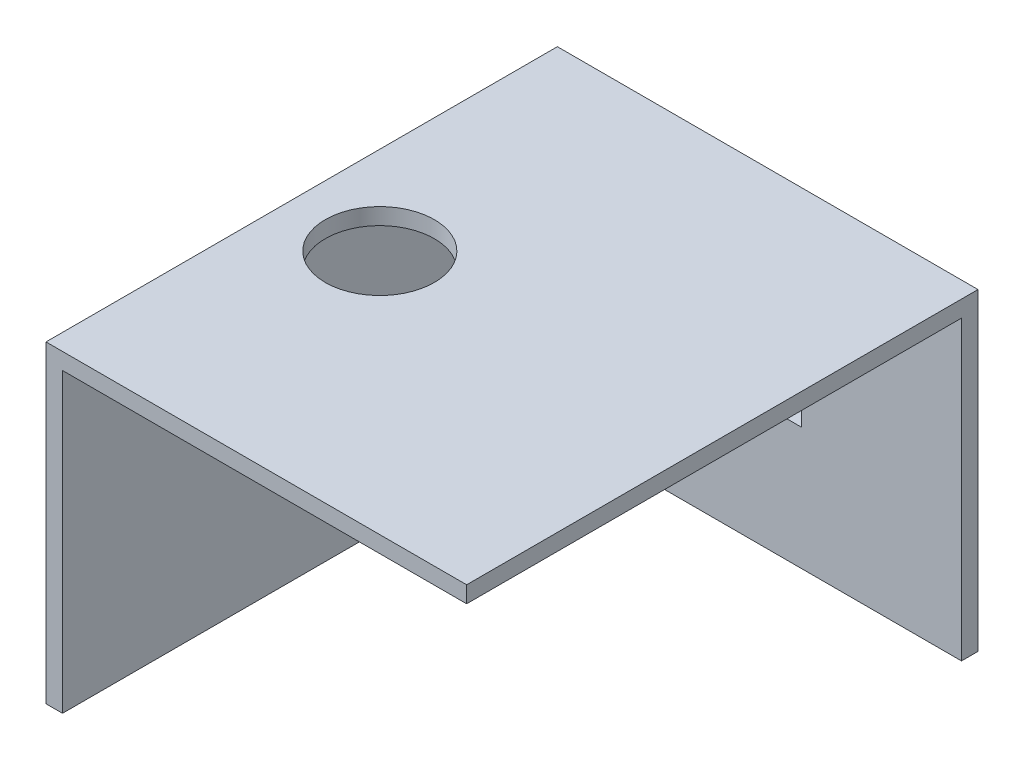
ISO-10303-21;
HEADER;
FILE_DESCRIPTION(('STEP AP214'),'2;1');
FILE_NAME('part.step','',(''),(''),'','','');
FILE_SCHEMA(('AUTOMOTIVE_DESIGN { 1 0 10303 214 1 1 1 1 }'));
ENDSEC;
DATA;
#1=APPLICATION_CONTEXT('core data for automotive mechanical design processes');
#2=APPLICATION_PROTOCOL_DEFINITION('international standard','automotive_design',2000,#1);
#3=PRODUCT_CONTEXT('',#1,'mechanical');
#4=PRODUCT('Part','Part','',(#3));
#5=PRODUCT_RELATED_PRODUCT_CATEGORY('part','',(#4));
#6=PRODUCT_DEFINITION_FORMATION('','',#4);
#7=PRODUCT_DEFINITION_CONTEXT('part definition',#1,'design');
#8=PRODUCT_DEFINITION('design','',#6,#7);
#9=PRODUCT_DEFINITION_SHAPE('','',#8);
#10=(LENGTH_UNIT() NAMED_UNIT(*) SI_UNIT(.MILLI.,.METRE.));
#11=(NAMED_UNIT(*) PLANE_ANGLE_UNIT() SI_UNIT($,.RADIAN.));
#12=(NAMED_UNIT(*) SI_UNIT($,.STERADIAN.) SOLID_ANGLE_UNIT());
#13=UNCERTAINTY_MEASURE_WITH_UNIT(LENGTH_MEASURE(1.E-05),#10,'distance_accuracy_value','');
#14=(GEOMETRIC_REPRESENTATION_CONTEXT(3) GLOBAL_UNCERTAINTY_ASSIGNED_CONTEXT((#13)) GLOBAL_UNIT_ASSIGNED_CONTEXT((#10,
#11,#12)) REPRESENTATION_CONTEXT('',''));
#15=CARTESIAN_POINT('',(0.,0.,0.));
#16=DIRECTION('',(0.,0.,1.));
#17=DIRECTION('',(1.,0.,0.));
#18=AXIS2_PLACEMENT_3D('',#15,#16,#17);
#19=CARTESIAN_POINT('',(-17.1967434177102,38.,20.7761195019784));
#20=DIRECTION('',(0.,0.,1.));
#21=DIRECTION('',(1.,0.,0.));
#22=AXIS2_PLACEMENT_3D('',#19,#20,#21);
#23=PLANE('',#22);
#24=DIRECTION('',(1.,0.,0.));
#25=VECTOR('',#24,1.);
#26=CARTESIAN_POINT('',(-17.1967434177102,40.,20.7761195019784));
#27=LINE('',#26,#25);
#28=CARTESIAN_POINT('',(-19.1967434177102,40.,20.7761195019784));
#29=VERTEX_POINT('',#28);
#30=CARTESIAN_POINT('',(31.8032565822898,40.,20.7761195019784));
#31=VERTEX_POINT('',#30);
#32=EDGE_CURVE('E202',#29,#31,#27,.T.);
#33=ORIENTED_EDGE('',*,*,#32,.F.);
#34=DIRECTION('',(0.,-1.,0.));
#35=VECTOR('',#34,1.);
#36=CARTESIAN_POINT('',(-19.1967434177102,40.,20.7761195019784));
#37=LINE('',#36,#35);
#38=CARTESIAN_POINT('',(-19.1967434177102,2.,20.7761195019784));
#39=VERTEX_POINT('',#38);
#40=EDGE_CURVE('E196',#29,#39,#37,.T.);
#41=ORIENTED_EDGE('',*,*,#40,.T.);
#42=DIRECTION('',(1.,0.,0.));
#43=VECTOR('',#42,1.);
#44=CARTESIAN_POINT('',(0.,2.,20.7761195019784));
#45=LINE('',#44,#43);
#46=CARTESIAN_POINT('',(-17.1967434177102,2.,20.7761195019784));
#47=VERTEX_POINT('',#46);
#48=EDGE_CURVE('E173',#39,#47,#45,.T.);
#49=ORIENTED_EDGE('',*,*,#48,.T.);
#50=DIRECTION('',(0.,-1.,0.));
#51=VECTOR('',#50,1.);
#52=CARTESIAN_POINT('',(-17.1967434177102,40.,20.7761195019784));
#53=LINE('',#52,#51);
#54=CARTESIAN_POINT('',(-17.1967434177102,38.,20.7761195019784));
#55=VERTEX_POINT('',#54);
#56=EDGE_CURVE('E194',#55,#47,#53,.T.);
#57=ORIENTED_EDGE('',*,*,#56,.F.);
#58=DIRECTION('',(1.,0.,0.));
#59=VECTOR('',#58,1.);
#60=CARTESIAN_POINT('',(-17.1967434177102,38.,20.7761195019784));
#61=LINE('',#60,#59);
#62=CARTESIAN_POINT('',(31.8032565822898,38.,20.7761195019784));
#63=VERTEX_POINT('',#62);
#64=EDGE_CURVE('E205',#55,#63,#61,.T.);
#65=ORIENTED_EDGE('',*,*,#64,.T.);
#66=DIRECTION('',(0.,1.,0.));
#67=VECTOR('',#66,1.);
#68=CARTESIAN_POINT('',(31.8032565822898,38.,20.7761195019784));
#69=LINE('',#68,#67);
#70=EDGE_CURVE('E11',#63,#31,#69,.T.);
#71=ORIENTED_EDGE('',*,*,#70,.T.);
#72=EDGE_LOOP('',(#33,#41,#49,#57,#65,#71));
#73=FACE_BOUND('',#72,.T.);
#74=ADVANCED_FACE('F47',(#73),#23,.T.);
#75=CARTESIAN_POINT('',(31.8032565822898,38.,-39.2238804980216));
#76=DIRECTION('',(-1.,0.,0.));
#77=DIRECTION('',(0.,0.,1.));
#78=AXIS2_PLACEMENT_3D('',#75,#76,#77);
#79=PLANE('',#78);
#80=DIRECTION('',(0.,0.,1.));
#81=VECTOR('',#80,1.);
#82=CARTESIAN_POINT('',(31.8032565822898,40.,-39.2238804980216));
#83=LINE('',#82,#81);
#84=CARTESIAN_POINT('',(31.8032565822896,40.,-41.2238804980216));
#85=VERTEX_POINT('',#84);
#86=EDGE_CURVE('E209',#85,#31,#83,.T.);
#87=ORIENTED_EDGE('',*,*,#86,.T.);
#88=ORIENTED_EDGE('',*,*,#70,.F.);
#89=DIRECTION('',(0.,0.,1.));
#90=VECTOR('',#89,1.);
#91=CARTESIAN_POINT('',(31.8032565822898,38.,-39.2238804980216));
#92=LINE('',#91,#90);
#93=CARTESIAN_POINT('',(31.8032565822898,38.,-39.2238804980216));
#94=VERTEX_POINT('',#93);
#95=EDGE_CURVE('E208',#94,#63,#92,.T.);
#96=ORIENTED_EDGE('',*,*,#95,.F.);
#97=DIRECTION('',(0.,-1.,0.));
#98=VECTOR('',#97,1.);
#99=CARTESIAN_POINT('',(31.8032565822896,40.,-39.2238804980216));
#100=LINE('',#99,#98);
#101=CARTESIAN_POINT('',(31.8032565822896,2.,-39.2238804980216));
#102=VERTEX_POINT('',#101);
#103=EDGE_CURVE('E190',#94,#102,#100,.T.);
#104=ORIENTED_EDGE('',*,*,#103,.T.);
#105=DIRECTION('',(0.,0.,-1.));
#106=VECTOR('',#105,1.);
#107=CARTESIAN_POINT('',(31.8032565822896,2.,0.));
#108=LINE('',#107,#106);
#109=CARTESIAN_POINT('',(31.8032565822896,2.,-41.2238804980216));
#110=VERTEX_POINT('',#109);
#111=EDGE_CURVE('E182',#102,#110,#108,.T.);
#112=ORIENTED_EDGE('',*,*,#111,.T.);
#113=DIRECTION('',(0.,-1.,0.));
#114=VECTOR('',#113,1.);
#115=CARTESIAN_POINT('',(31.8032565822896,40.,-41.2238804980216));
#116=LINE('',#115,#114);
#117=EDGE_CURVE('E187',#85,#110,#116,.T.);
#118=ORIENTED_EDGE('',*,*,#117,.F.);
#119=EDGE_LOOP('',(#87,#88,#96,#104,#112,#118));
#120=FACE_BOUND('',#119,.T.);
#121=ADVANCED_FACE('F220',(#120),#79,.F.);
#122=CARTESIAN_POINT('',(0.,38.,0.));
#123=DIRECTION('',(0.,-1.,0.));
#124=DIRECTION('',(0.,0.,-1.));
#125=AXIS2_PLACEMENT_3D('',#122,#123,#124);
#126=PLANE('',#125);
#127=CARTESIAN_POINT('',(-8.5,38.,-9.));
#128=DIRECTION('',(0.,1.,0.));
#129=DIRECTION('',(0.,0.,1.));
#130=AXIS2_PLACEMENT_3D('',#127,#128,#129);
#131=CIRCLE('',#130,6.60911000448082);
#132=CARTESIAN_POINT('',(-8.5,38.,-2.39088999551917));
#133=VERTEX_POINT('',#132);
#134=EDGE_CURVE('E199',#133,#133,#131,.T.);
#135=ORIENTED_EDGE('',*,*,#134,.T.);
#136=EDGE_LOOP('',(#135));
#137=FACE_BOUND('',#136,.T.);
#138=ORIENTED_EDGE('',*,*,#64,.F.);
#139=DIRECTION('',(0.,0.,1.));
#140=VECTOR('',#139,1.);
#141=CARTESIAN_POINT('',(-17.1967434177102,38.,-39.2238804980216));
#142=LINE('',#141,#140);
#143=CARTESIAN_POINT('',(-17.1967434177102,38.,-39.2238804980216));
#144=VERTEX_POINT('',#143);
#145=EDGE_CURVE('E54',#144,#55,#142,.T.);
#146=ORIENTED_EDGE('',*,*,#145,.F.);
#147=DIRECTION('',(1.,0.,0.));
#148=VECTOR('',#147,1.);
#149=CARTESIAN_POINT('',(-17.1967434177102,38.,-39.2238804980216));
#150=LINE('',#149,#148);
#151=EDGE_CURVE('E211',#144,#94,#150,.T.);
#152=ORIENTED_EDGE('',*,*,#151,.T.);
#153=ORIENTED_EDGE('',*,*,#95,.T.);
#154=EDGE_LOOP('',(#138,#146,#152,#153));
#155=FACE_BOUND('',#154,.T.);
#156=ADVANCED_FACE('F243',(#137,#155),#126,.T.);
#157=CARTESIAN_POINT('',(0.,40.,0.));
#158=DIRECTION('',(0.,-1.,0.));
#159=DIRECTION('',(0.,0.,-1.));
#160=AXIS2_PLACEMENT_3D('',#157,#158,#159);
#161=PLANE('',#160);
#162=CARTESIAN_POINT('',(-8.5,40.,-9.));
#163=DIRECTION('',(0.,1.,0.));
#164=DIRECTION('',(0.,0.,1.));
#165=AXIS2_PLACEMENT_3D('',#162,#163,#164);
#166=CIRCLE('',#165,6.60911000448082);
#167=CARTESIAN_POINT('',(-8.5,40.,-2.39088999551917));
#168=VERTEX_POINT('',#167);
#169=EDGE_CURVE('E198',#168,#168,#166,.T.);
#170=ORIENTED_EDGE('',*,*,#169,.F.);
#171=EDGE_LOOP('',(#170));
#172=FACE_BOUND('',#171,.T.);
#173=ORIENTED_EDGE('',*,*,#32,.T.);
#174=ORIENTED_EDGE('',*,*,#86,.F.);
#175=DIRECTION('',(-1.,0.,0.));
#176=VECTOR('',#175,1.);
#177=CARTESIAN_POINT('',(0.,40.,-41.2238804980216));
#178=LINE('',#177,#176);
#179=CARTESIAN_POINT('',(-19.1967434177102,40.,-41.2238804980216));
#180=VERTEX_POINT('',#179);
#181=EDGE_CURVE('E167',#85,#180,#178,.T.);
#182=ORIENTED_EDGE('',*,*,#181,.T.);
#183=DIRECTION('',(0.,0.,-1.));
#184=VECTOR('',#183,1.);
#185=CARTESIAN_POINT('',(-19.1967434177102,40.,0.));
#186=LINE('',#185,#184);
#187=EDGE_CURVE('E164',#29,#180,#186,.T.);
#188=ORIENTED_EDGE('',*,*,#187,.F.);
#189=EDGE_LOOP('',(#173,#174,#182,#188));
#190=FACE_BOUND('',#189,.T.);
#191=ADVANCED_FACE('F225',(#172,#190),#161,.F.);
#192=CARTESIAN_POINT('',(-8.5,38.,-9.));
#193=DIRECTION('',(0.,1.,0.));
#194=DIRECTION('',(0.,0.,1.));
#195=AXIS2_PLACEMENT_3D('',#192,#193,#194);
#196=CYLINDRICAL_SURFACE('',#195,6.60911000448082);
#197=ORIENTED_EDGE('',*,*,#134,.F.);
#198=EDGE_LOOP('',(#197));
#199=FACE_BOUND('',#198,.T.);
#200=ORIENTED_EDGE('',*,*,#169,.T.);
#201=EDGE_LOOP('',(#200));
#202=FACE_BOUND('',#201,.T.);
#203=ADVANCED_FACE('F250',(#199,#202),#196,.F.);
#204=CARTESIAN_POINT('',(-17.1967434177102,40.,0.));
#205=DIRECTION('',(-1.,0.,0.));
#206=DIRECTION('',(0.,0.,1.));
#207=AXIS2_PLACEMENT_3D('',#204,#205,#206);
#208=PLANE('',#207);
#209=DIRECTION('',(0.,-1.,0.));
#210=VECTOR('',#209,1.);
#211=CARTESIAN_POINT('',(-17.1967434177102,40.,-39.2238804980216));
#212=LINE('',#211,#210);
#213=CARTESIAN_POINT('',(-17.1967434177102,2.,-39.2238804980216));
#214=VERTEX_POINT('',#213);
#215=EDGE_CURVE('E192',#144,#214,#212,.T.);
#216=ORIENTED_EDGE('',*,*,#215,.F.);
#217=ORIENTED_EDGE('',*,*,#145,.T.);
#218=ORIENTED_EDGE('',*,*,#56,.T.);
#219=DIRECTION('',(0.,0.,-1.));
#220=VECTOR('',#219,1.);
#221=CARTESIAN_POINT('',(-17.1967434177102,2.,0.));
#222=LINE('',#221,#220);
#223=EDGE_CURVE('E176',#47,#214,#222,.T.);
#224=ORIENTED_EDGE('',*,*,#223,.T.);
#225=EDGE_LOOP('',(#216,#217,#218,#224));
#226=FACE_BOUND('',#225,.T.);
#227=ADVANCED_FACE('F248',(#226),#208,.F.);
#228=CARTESIAN_POINT('',(0.,40.,-39.2238804980216));
#229=DIRECTION('',(0.,0.,1.));
#230=DIRECTION('',(1.,0.,0.));
#231=AXIS2_PLACEMENT_3D('',#228,#229,#230);
#232=PLANE('',#231);
#233=DIRECTION('',(0.,1.,0.));
#234=VECTOR('',#233,1.);
#235=CARTESIAN_POINT('',(12.4036346371383,40.,-39.2238804980216));
#236=LINE('',#235,#234);
#237=CARTESIAN_POINT('',(12.4036346371383,16.8437028668791,-39.2238804980216));
#238=VERTEX_POINT('',#237);
#239=CARTESIAN_POINT('',(12.4036346371383,24.7926008250943,-39.2238804980216));
#240=VERTEX_POINT('',#239);
#241=EDGE_CURVE('E161',#238,#240,#236,.T.);
#242=ORIENTED_EDGE('',*,*,#241,.F.);
#243=DIRECTION('',(1.,0.,0.));
#244=VECTOR('',#243,1.);
#245=CARTESIAN_POINT('',(0.,16.8437028668791,-39.2238804980216));
#246=LINE('',#245,#244);
#247=CARTESIAN_POINT('',(0.,16.8437028668791,-39.2238804980216));
#248=VERTEX_POINT('',#247);
#249=EDGE_CURVE('E154',#248,#238,#246,.T.);
#250=ORIENTED_EDGE('',*,*,#249,.F.);
#251=DIRECTION('',(0.,-1.,0.));
#252=VECTOR('',#251,1.);
#253=CARTESIAN_POINT('',(0.,40.,-39.2238804980216));
#254=LINE('',#253,#252);
#255=CARTESIAN_POINT('',(0.,24.7926008250943,-39.2238804980216));
#256=VERTEX_POINT('',#255);
#257=EDGE_CURVE('E134',#256,#248,#254,.T.);
#258=ORIENTED_EDGE('',*,*,#257,.F.);
#259=DIRECTION('',(-1.,0.,0.));
#260=VECTOR('',#259,1.);
#261=CARTESIAN_POINT('',(0.,24.7926008250943,-39.2238804980216));
#262=LINE('',#261,#260);
#263=EDGE_CURVE('E159',#240,#256,#262,.T.);
#264=ORIENTED_EDGE('',*,*,#263,.F.);
#265=EDGE_LOOP('',(#242,#250,#258,#264));
#266=FACE_BOUND('',#265,.T.);
#267=ORIENTED_EDGE('',*,*,#151,.F.);
#268=ORIENTED_EDGE('',*,*,#215,.T.);
#269=DIRECTION('',(-1.,0.,0.));
#270=VECTOR('',#269,1.);
#271=CARTESIAN_POINT('',(0.,2.,-39.2238804980216));
#272=LINE('',#271,#270);
#273=EDGE_CURVE('E179',#102,#214,#272,.T.);
#274=ORIENTED_EDGE('',*,*,#273,.F.);
#275=ORIENTED_EDGE('',*,*,#103,.F.);
#276=EDGE_LOOP('',(#267,#268,#274,#275));
#277=FACE_BOUND('',#276,.T.);
#278=ADVANCED_FACE('F246',(#266,#277),#232,.T.);
#279=CARTESIAN_POINT('',(-19.1967434177102,40.,0.));
#280=DIRECTION('',(-1.,0.,0.));
#281=DIRECTION('',(0.,0.,1.));
#282=AXIS2_PLACEMENT_3D('',#279,#280,#281);
#283=PLANE('',#282);
#284=DIRECTION('',(0.,0.,-1.));
#285=VECTOR('',#284,1.);
#286=CARTESIAN_POINT('',(-19.1967434177102,2.,0.));
#287=LINE('',#286,#285);
#288=CARTESIAN_POINT('',(-19.1967434177102,2.,-41.2238804980216));
#289=VERTEX_POINT('',#288);
#290=EDGE_CURVE('E163',#39,#289,#287,.T.);
#291=ORIENTED_EDGE('',*,*,#290,.F.);
#292=ORIENTED_EDGE('',*,*,#40,.F.);
#293=ORIENTED_EDGE('',*,*,#187,.T.);
#294=DIRECTION('',(0.,-1.,0.));
#295=VECTOR('',#294,1.);
#296=CARTESIAN_POINT('',(-19.1967434177102,40.,-41.2238804980216));
#297=LINE('',#296,#295);
#298=EDGE_CURVE('E170',#180,#289,#297,.T.);
#299=ORIENTED_EDGE('',*,*,#298,.T.);
#300=EDGE_LOOP('',(#291,#292,#293,#299));
#301=FACE_BOUND('',#300,.T.);
#302=ADVANCED_FACE('F231',(#301),#283,.T.);
#303=CARTESIAN_POINT('',(0.,40.,-41.2238804980216));
#304=DIRECTION('',(0.,0.,1.));
#305=DIRECTION('',(1.,0.,0.));
#306=AXIS2_PLACEMENT_3D('',#303,#304,#305);
#307=PLANE('',#306);
#308=DIRECTION('',(-1.,0.,0.));
#309=VECTOR('',#308,1.);
#310=CARTESIAN_POINT('',(12.4036346371383,16.8437028668791,-41.2238804980216));
#311=LINE('',#310,#309);
#312=CARTESIAN_POINT('',(12.4036346371383,16.8437028668791,-41.2238804980216));
#313=VERTEX_POINT('',#312);
#314=CARTESIAN_POINT('',(0.,16.8437028668791,-41.2238804980216));
#315=VERTEX_POINT('',#314);
#316=EDGE_CURVE('E140',#313,#315,#311,.T.);
#317=ORIENTED_EDGE('',*,*,#316,.F.);
#318=DIRECTION('',(0.,-1.,0.));
#319=VECTOR('',#318,1.);
#320=CARTESIAN_POINT('',(12.4036346371383,24.7926008250943,-41.2238804980216));
#321=LINE('',#320,#319);
#322=CARTESIAN_POINT('',(12.4036346371383,24.7926008250943,-41.2238804980216));
#323=VERTEX_POINT('',#322);
#324=EDGE_CURVE('E69',#323,#313,#321,.T.);
#325=ORIENTED_EDGE('',*,*,#324,.F.);
#326=DIRECTION('',(1.,0.,0.));
#327=VECTOR('',#326,1.);
#328=CARTESIAN_POINT('',(12.4036346371383,24.7926008250943,-41.2238804980216));
#329=LINE('',#328,#327);
#330=CARTESIAN_POINT('',(0.,24.7926008250943,-41.2238804980216));
#331=VERTEX_POINT('',#330);
#332=EDGE_CURVE('E147',#331,#323,#329,.T.);
#333=ORIENTED_EDGE('',*,*,#332,.F.);
#334=DIRECTION('',(0.,1.,0.));
#335=VECTOR('',#334,1.);
#336=CARTESIAN_POINT('',(0.,24.7926008250943,-41.2238804980216));
#337=LINE('',#336,#335);
#338=EDGE_CURVE('E131',#315,#331,#337,.T.);
#339=ORIENTED_EDGE('',*,*,#338,.F.);
#340=EDGE_LOOP('',(#317,#325,#333,#339));
#341=FACE_BOUND('',#340,.T.);
#342=DIRECTION('',(-1.,0.,0.));
#343=VECTOR('',#342,1.);
#344=CARTESIAN_POINT('',(0.,2.,-41.2238804980216));
#345=LINE('',#344,#343);
#346=EDGE_CURVE('E168',#110,#289,#345,.T.);
#347=ORIENTED_EDGE('',*,*,#346,.T.);
#348=ORIENTED_EDGE('',*,*,#298,.F.);
#349=ORIENTED_EDGE('',*,*,#181,.F.);
#350=ORIENTED_EDGE('',*,*,#117,.T.);
#351=EDGE_LOOP('',(#347,#348,#349,#350));
#352=FACE_BOUND('',#351,.T.);
#353=ADVANCED_FACE('F144',(#341,#352),#307,.F.);
#354=CARTESIAN_POINT('',(0.,2.,0.));
#355=DIRECTION('',(0.,1.,0.));
#356=DIRECTION('',(0.,0.,1.));
#357=AXIS2_PLACEMENT_3D('',#354,#355,#356);
#358=PLANE('',#357);
#359=ORIENTED_EDGE('',*,*,#290,.T.);
#360=ORIENTED_EDGE('',*,*,#346,.F.);
#361=ORIENTED_EDGE('',*,*,#111,.F.);
#362=ORIENTED_EDGE('',*,*,#273,.T.);
#363=ORIENTED_EDGE('',*,*,#223,.F.);
#364=ORIENTED_EDGE('',*,*,#48,.F.);
#365=EDGE_LOOP('',(#359,#360,#361,#362,#363,#364));
#366=FACE_BOUND('',#365,.T.);
#367=ADVANCED_FACE('F235',(#366),#358,.F.);
#368=CARTESIAN_POINT('',(12.4036346371383,24.7926008250943,-37.2238804980216));
#369=DIRECTION('',(1.,0.,0.));
#370=DIRECTION('',(0.,0.,-1.));
#371=AXIS2_PLACEMENT_3D('',#368,#369,#370);
#372=PLANE('',#371);
#373=ORIENTED_EDGE('',*,*,#241,.T.);
#374=DIRECTION('',(0.,0.,-1.));
#375=VECTOR('',#374,1.);
#376=CARTESIAN_POINT('',(12.4036346371383,24.7926008250943,-37.2238804980216));
#377=LINE('',#376,#375);
#378=EDGE_CURVE('E152',#240,#323,#377,.T.);
#379=ORIENTED_EDGE('',*,*,#378,.T.);
#380=ORIENTED_EDGE('',*,*,#324,.T.);
#381=DIRECTION('',(0.,0.,-1.));
#382=VECTOR('',#381,1.);
#383=CARTESIAN_POINT('',(12.4036346371383,16.8437028668791,-37.2238804980216));
#384=LINE('',#383,#382);
#385=EDGE_CURVE('E137',#238,#313,#384,.T.);
#386=ORIENTED_EDGE('',*,*,#385,.F.);
#387=EDGE_LOOP('',(#373,#379,#380,#386));
#388=FACE_BOUND('',#387,.T.);
#389=ADVANCED_FACE('F289',(#388),#372,.F.);
#390=CARTESIAN_POINT('',(12.4036346371383,24.7926008250943,-37.2238804980216));
#391=DIRECTION('',(0.,1.,0.));
#392=DIRECTION('',(0.,0.,1.));
#393=AXIS2_PLACEMENT_3D('',#390,#391,#392);
#394=PLANE('',#393);
#395=ORIENTED_EDGE('',*,*,#263,.T.);
#396=DIRECTION('',(0.,0.,-1.));
#397=VECTOR('',#396,1.);
#398=CARTESIAN_POINT('',(0.,24.7926008250943,-37.2238804980216));
#399=LINE('',#398,#397);
#400=EDGE_CURVE('E136',#256,#331,#399,.T.);
#401=ORIENTED_EDGE('',*,*,#400,.T.);
#402=ORIENTED_EDGE('',*,*,#332,.T.);
#403=ORIENTED_EDGE('',*,*,#378,.F.);
#404=EDGE_LOOP('',(#395,#401,#402,#403));
#405=FACE_BOUND('',#404,.T.);
#406=ADVANCED_FACE('F294',(#405),#394,.F.);
#407=CARTESIAN_POINT('',(0.,24.7926008250943,-37.2238804980216));
#408=DIRECTION('',(-1.,0.,0.));
#409=DIRECTION('',(0.,0.,1.));
#410=AXIS2_PLACEMENT_3D('',#407,#408,#409);
#411=PLANE('',#410);
#412=ORIENTED_EDGE('',*,*,#257,.T.);
#413=DIRECTION('',(0.,0.,-1.));
#414=VECTOR('',#413,1.);
#415=CARTESIAN_POINT('',(0.,16.8437028668791,-37.2238804980216));
#416=LINE('',#415,#414);
#417=EDGE_CURVE('E61',#248,#315,#416,.T.);
#418=ORIENTED_EDGE('',*,*,#417,.T.);
#419=ORIENTED_EDGE('',*,*,#338,.T.);
#420=ORIENTED_EDGE('',*,*,#400,.F.);
#421=EDGE_LOOP('',(#412,#418,#419,#420));
#422=FACE_BOUND('',#421,.T.);
#423=ADVANCED_FACE('F128',(#422),#411,.F.);
#424=CARTESIAN_POINT('',(12.4036346371383,16.8437028668791,-37.2238804980216));
#425=DIRECTION('',(0.,-1.,0.));
#426=DIRECTION('',(0.,0.,-1.));
#427=AXIS2_PLACEMENT_3D('',#424,#425,#426);
#428=PLANE('',#427);
#429=ORIENTED_EDGE('',*,*,#249,.T.);
#430=ORIENTED_EDGE('',*,*,#385,.T.);
#431=ORIENTED_EDGE('',*,*,#316,.T.);
#432=ORIENTED_EDGE('',*,*,#417,.F.);
#433=EDGE_LOOP('',(#429,#430,#431,#432));
#434=FACE_BOUND('',#433,.T.);
#435=ADVANCED_FACE('F141',(#434),#428,.F.);
#436=CLOSED_SHELL('',(#74,#121,#156,#191,#203,#227,#278,#302,#353,#367,#389,#406,#423,#435));
#437=MANIFOLD_SOLID_BREP('B2',#436);
#438=ADVANCED_BREP_SHAPE_REPRESENTATION('',(#18,#437),#14);
#439=SHAPE_DEFINITION_REPRESENTATION(#9,#438);
ENDSEC;
END-ISO-10303-21;
